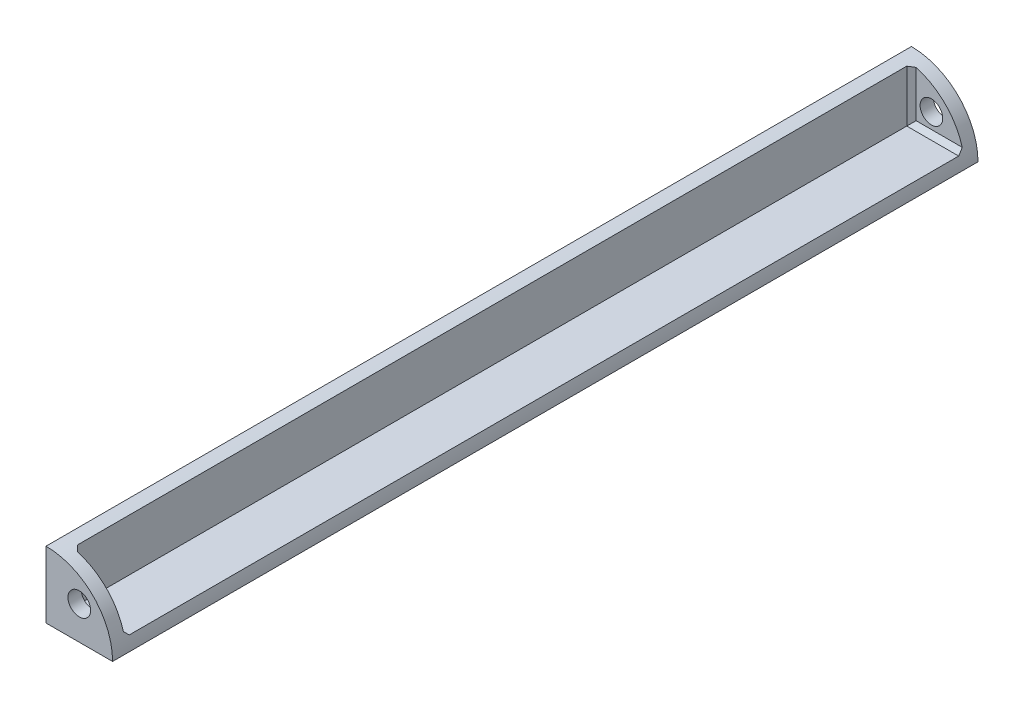
ISO-10303-21;
HEADER;
FILE_DESCRIPTION(('STEP AP214'),'2;1');
FILE_NAME('part.step','',(''),(''),'','','');
FILE_SCHEMA(('AUTOMOTIVE_DESIGN { 1 0 10303 214 1 1 1 1 }'));
ENDSEC;
DATA;
#1=APPLICATION_CONTEXT('core data for automotive mechanical design processes');
#2=APPLICATION_PROTOCOL_DEFINITION('international standard','automotive_design',2000,#1);
#3=PRODUCT_CONTEXT('',#1,'mechanical');
#4=PRODUCT('Part','Part','',(#3));
#5=PRODUCT_RELATED_PRODUCT_CATEGORY('part','',(#4));
#6=PRODUCT_DEFINITION_FORMATION('','',#4);
#7=PRODUCT_DEFINITION_CONTEXT('part definition',#1,'design');
#8=PRODUCT_DEFINITION('design','',#6,#7);
#9=PRODUCT_DEFINITION_SHAPE('','',#8);
#10=(LENGTH_UNIT() NAMED_UNIT(*) SI_UNIT(.MILLI.,.METRE.));
#11=(NAMED_UNIT(*) PLANE_ANGLE_UNIT() SI_UNIT($,.RADIAN.));
#12=(NAMED_UNIT(*) SI_UNIT($,.STERADIAN.) SOLID_ANGLE_UNIT());
#13=UNCERTAINTY_MEASURE_WITH_UNIT(LENGTH_MEASURE(1.E-05),#10,'distance_accuracy_value','');
#14=(GEOMETRIC_REPRESENTATION_CONTEXT(3) GLOBAL_UNCERTAINTY_ASSIGNED_CONTEXT((#13)) GLOBAL_UNIT_ASSIGNED_CONTEXT((#10,
#11,#12)) REPRESENTATION_CONTEXT('',''));
#15=CARTESIAN_POINT('',(0.,0.,0.));
#16=DIRECTION('',(0.,0.,1.));
#17=DIRECTION('',(1.,0.,0.));
#18=AXIS2_PLACEMENT_3D('',#15,#16,#17);
#19=CARTESIAN_POINT('',(0.,0.,2.));
#20=DIRECTION('',(0.,0.,1.));
#21=DIRECTION('',(1.,0.,0.));
#22=AXIS2_PLACEMENT_3D('',#19,#20,#21);
#23=PLANE('',#22);
#24=CARTESIAN_POINT('',(5.,5.,2.));
#25=DIRECTION('',(0.,0.,1.));
#26=DIRECTION('',(1.,0.,0.));
#27=AXIS2_PLACEMENT_3D('',#24,#25,#26);
#28=CIRCLE('',#27,1.7);
#29=CARTESIAN_POINT('',(6.7,5.,2.));
#30=VERTEX_POINT('',#29);
#31=EDGE_CURVE('E172',#30,#30,#28,.T.);
#32=ORIENTED_EDGE('',*,*,#31,.F.);
#33=EDGE_LOOP('',(#32));
#34=FACE_BOUND('',#33,.T.);
#35=CARTESIAN_POINT('',(0.,0.,2.));
#36=DIRECTION('',(0.,0.,1.));
#37=DIRECTION('',(1.,0.,0.));
#38=AXIS2_PLACEMENT_3D('',#35,#36,#37);
#39=CIRCLE('',#38,10.);
#40=CARTESIAN_POINT('',(9.62860322165163,2.69999999999998,2.));
#41=VERTEX_POINT('',#40);
#42=CARTESIAN_POINT('',(2.69999999999998,9.62860322165163,2.));
#43=VERTEX_POINT('',#42);
#44=EDGE_CURVE('E180',#41,#43,#39,.T.);
#45=ORIENTED_EDGE('',*,*,#44,.T.);
#46=DIRECTION('',(0.,-1.,0.));
#47=VECTOR('',#46,1.);
#48=CARTESIAN_POINT('',(2.69999999999998,0.,2.));
#49=LINE('',#48,#47);
#50=CARTESIAN_POINT('',(2.69999999999998,2.69999999999998,2.));
#51=VERTEX_POINT('',#50);
#52=EDGE_CURVE('E206',#43,#51,#49,.T.);
#53=ORIENTED_EDGE('',*,*,#52,.T.);
#54=DIRECTION('',(1.,0.,0.));
#55=VECTOR('',#54,1.);
#56=CARTESIAN_POINT('',(9.79795897113272,2.69999999999998,2.));
#57=LINE('',#56,#55);
#58=EDGE_CURVE('E203',#51,#41,#57,.T.);
#59=ORIENTED_EDGE('',*,*,#58,.T.);
#60=EDGE_LOOP('',(#45,#53,#59));
#61=FACE_BOUND('',#60,.T.);
#62=ADVANCED_FACE('F43',(#34,#61),#23,.T.);
#63=CARTESIAN_POINT('',(0.,0.,0.));
#64=DIRECTION('',(0.,0.,1.));
#65=DIRECTION('',(1.,0.,0.));
#66=AXIS2_PLACEMENT_3D('',#63,#64,#65);
#67=PLANE('',#66);
#68=DIRECTION('',(1.,0.,0.));
#69=VECTOR('',#68,1.);
#70=CARTESIAN_POINT('',(0.,0.,0.));
#71=LINE('',#70,#69);
#72=CARTESIAN_POINT('',(0.,0.,0.));
#73=VERTEX_POINT('',#72);
#74=CARTESIAN_POINT('',(10.,0.,0.));
#75=VERTEX_POINT('',#74);
#76=EDGE_CURVE('E176',#73,#75,#71,.T.);
#77=ORIENTED_EDGE('',*,*,#76,.F.);
#78=DIRECTION('',(0.,-1.,0.));
#79=VECTOR('',#78,1.);
#80=CARTESIAN_POINT('',(0.,0.,0.));
#81=LINE('',#80,#79);
#82=CARTESIAN_POINT('',(0.,10.,0.));
#83=VERTEX_POINT('',#82);
#84=EDGE_CURVE('E184',#83,#73,#81,.T.);
#85=ORIENTED_EDGE('',*,*,#84,.F.);
#86=CARTESIAN_POINT('',(0.,0.,0.));
#87=DIRECTION('',(0.,0.,1.));
#88=DIRECTION('',(1.,0.,0.));
#89=AXIS2_PLACEMENT_3D('',#86,#87,#88);
#90=CIRCLE('',#89,10.);
#91=EDGE_CURVE('E123',#75,#83,#90,.T.);
#92=ORIENTED_EDGE('',*,*,#91,.F.);
#93=EDGE_LOOP('',(#77,#85,#92));
#94=FACE_BOUND('',#93,.T.);
#95=CARTESIAN_POINT('',(5.,5.,0.));
#96=DIRECTION('',(0.,0.,1.));
#97=DIRECTION('',(1.,0.,0.));
#98=AXIS2_PLACEMENT_3D('',#95,#96,#97);
#99=CIRCLE('',#98,1.7);
#100=CARTESIAN_POINT('',(6.7,5.,0.));
#101=VERTEX_POINT('',#100);
#102=EDGE_CURVE('E171',#101,#101,#99,.T.);
#103=ORIENTED_EDGE('',*,*,#102,.T.);
#104=EDGE_LOOP('',(#103));
#105=FACE_BOUND('',#104,.T.);
#106=ADVANCED_FACE('F271',(#94,#105),#67,.F.);
#107=CARTESIAN_POINT('',(0.,0.,2.));
#108=DIRECTION('',(0.,1.,0.));
#109=DIRECTION('',(0.,0.,1.));
#110=AXIS2_PLACEMENT_3D('',#107,#108,#109);
#111=PLANE('',#110);
#112=ORIENTED_EDGE('',*,*,#76,.T.);
#113=DIRECTION('',(0.,0.,-1.));
#114=VECTOR('',#113,1.);
#115=CARTESIAN_POINT('',(10.,0.,2.));
#116=LINE('',#115,#114);
#117=CARTESIAN_POINT('',(10.,0.,130.));
#118=VERTEX_POINT('',#117);
#119=EDGE_CURVE('E127',#118,#75,#116,.T.);
#120=ORIENTED_EDGE('',*,*,#119,.F.);
#121=DIRECTION('',(1.,0.,0.));
#122=VECTOR('',#121,1.);
#123=CARTESIAN_POINT('',(0.,0.,130.));
#124=LINE('',#123,#122);
#125=CARTESIAN_POINT('',(0.,0.,130.));
#126=VERTEX_POINT('',#125);
#127=EDGE_CURVE('E138',#126,#118,#124,.T.);
#128=ORIENTED_EDGE('',*,*,#127,.F.);
#129=DIRECTION('',(0.,0.,-1.));
#130=VECTOR('',#129,1.);
#131=CARTESIAN_POINT('',(0.,0.,2.));
#132=LINE('',#131,#130);
#133=EDGE_CURVE('E128',#126,#73,#132,.T.);
#134=ORIENTED_EDGE('',*,*,#133,.T.);
#135=EDGE_LOOP('',(#112,#120,#128,#134));
#136=FACE_BOUND('',#135,.T.);
#137=ADVANCED_FACE('F277',(#136),#111,.F.);
#138=CARTESIAN_POINT('',(0.,0.,2.));
#139=DIRECTION('',(0.,0.,-1.));
#140=DIRECTION('',(-1.,0.,0.));
#141=AXIS2_PLACEMENT_3D('',#138,#139,#140);
#142=CYLINDRICAL_SURFACE('',#141,10.);
#143=DIRECTION('',(0.,0.,-1.));
#144=VECTOR('',#143,1.);
#145=CARTESIAN_POINT('',(0.,10.,2.));
#146=LINE('',#145,#144);
#147=CARTESIAN_POINT('',(0.,10.,130.));
#148=VERTEX_POINT('',#147);
#149=EDGE_CURVE('E117',#148,#83,#146,.T.);
#150=ORIENTED_EDGE('',*,*,#149,.F.);
#151=CARTESIAN_POINT('',(-8.66494376250415E-13,-8.66494376250415E-13,130.));
#152=DIRECTION('',(0.,0.,1.));
#153=DIRECTION('',(1.,0.,0.));
#154=AXIS2_PLACEMENT_3D('',#151,#152,#153);
#155=CIRCLE('',#154,10.0000000000009);
#156=EDGE_CURVE('E122',#148,#118,#155,.F.);
#157=ORIENTED_EDGE('',*,*,#156,.T.);
#158=ORIENTED_EDGE('',*,*,#119,.T.);
#159=ORIENTED_EDGE('',*,*,#91,.T.);
#160=EDGE_LOOP('',(#150,#157,#158,#159));
#161=FACE_BOUND('',#160,.T.);
#162=CARTESIAN_POINT('',(-8.66494376250415E-13,-8.66494376250415E-13,128.));
#163=DIRECTION('',(0.,0.,1.));
#164=DIRECTION('',(1.,0.,0.));
#165=AXIS2_PLACEMENT_3D('',#162,#163,#164);
#166=CIRCLE('',#165,10.0000000000009);
#167=CARTESIAN_POINT('',(2.69999999999999,9.62860322165142,128.));
#168=VERTEX_POINT('',#167);
#169=CARTESIAN_POINT('',(9.62860322165142,2.69999999999999,128.));
#170=VERTEX_POINT('',#169);
#171=EDGE_CURVE('E147',#168,#170,#166,.F.);
#172=ORIENTED_EDGE('',*,*,#171,.F.);
#173=CARTESIAN_POINT('',(0.,0.,125.3));
#174=DIRECTION('',(0.707106781186548,0.,-0.707106781186548));
#175=DIRECTION('',(-0.707106781186548,0.,-0.707106781186548));
#176=AXIS2_PLACEMENT_3D('',#173,#174,#175);
#177=ELLIPSE('',#176,14.1421356237309,10.);
#178=CARTESIAN_POINT('',(1.99999999999999,9.79795897113272,127.3));
#179=VERTEX_POINT('',#178);
#180=EDGE_CURVE('E11',#168,#179,#177,.F.);
#181=ORIENTED_EDGE('',*,*,#180,.T.);
#182=DIRECTION('',(0.,0.,-1.));
#183=VECTOR('',#182,1.);
#184=CARTESIAN_POINT('',(1.99999999999999,9.79795897113272,128.));
#185=LINE('',#184,#183);
#186=CARTESIAN_POINT('',(1.99999999999999,9.79795897113272,2.69999999999998));
#187=VERTEX_POINT('',#186);
#188=EDGE_CURVE('E163',#179,#187,#185,.T.);
#189=ORIENTED_EDGE('',*,*,#188,.T.);
#190=CARTESIAN_POINT('',(0.,0.,4.69999999999993));
#191=DIRECTION('',(-0.707106781186541,0.,-0.707106781186554));
#192=DIRECTION('',(0.707106781186554,0.,-0.707106781186541));
#193=AXIS2_PLACEMENT_3D('',#190,#191,#192);
#194=ELLIPSE('',#193,14.1421356237308,10.);
#195=EDGE_CURVE('E221',#187,#43,#194,.T.);
#196=ORIENTED_EDGE('',*,*,#195,.T.);
#197=ORIENTED_EDGE('',*,*,#44,.F.);
#198=CARTESIAN_POINT('',(0.,0.,4.69999999999993));
#199=DIRECTION('',(0.,0.707106781186541,0.707106781186554));
#200=DIRECTION('',(0.,0.707106781186554,-0.707106781186541));
#201=AXIS2_PLACEMENT_3D('',#198,#199,#200);
#202=ELLIPSE('',#201,14.1421356237308,10.);
#203=CARTESIAN_POINT('',(9.79795897113272,1.99999999999999,2.69999999999998));
#204=VERTEX_POINT('',#203);
#205=EDGE_CURVE('E224',#41,#204,#202,.F.);
#206=ORIENTED_EDGE('',*,*,#205,.T.);
#207=DIRECTION('',(0.,0.,-1.));
#208=VECTOR('',#207,1.);
#209=CARTESIAN_POINT('',(9.79795897113272,1.99999999999999,128.));
#210=LINE('',#209,#208);
#211=CARTESIAN_POINT('',(9.79795897113272,1.99999999999999,127.3));
#212=VERTEX_POINT('',#211);
#213=EDGE_CURVE('E156',#212,#204,#210,.T.);
#214=ORIENTED_EDGE('',*,*,#213,.F.);
#215=CARTESIAN_POINT('',(0.,0.,125.3));
#216=DIRECTION('',(0.,-0.707106781186548,0.707106781186548));
#217=DIRECTION('',(0.,-0.707106781186548,-0.707106781186548));
#218=AXIS2_PLACEMENT_3D('',#215,#216,#217);
#219=ELLIPSE('',#218,14.1421356237309,10.);
#220=EDGE_CURVE('E54',#212,#170,#219,.T.);
#221=ORIENTED_EDGE('',*,*,#220,.T.);
#222=EDGE_LOOP('',(#172,#181,#189,#196,#197,#206,#214,#221));
#223=FACE_BOUND('',#222,.T.);
#224=ADVANCED_FACE('F119',(#161,#223),#142,.T.);
#225=CARTESIAN_POINT('',(0.,0.,2.));
#226=DIRECTION('',(1.,0.,0.));
#227=DIRECTION('',(0.,0.,-1.));
#228=AXIS2_PLACEMENT_3D('',#225,#226,#227);
#229=PLANE('',#228);
#230=ORIENTED_EDGE('',*,*,#84,.T.);
#231=ORIENTED_EDGE('',*,*,#133,.F.);
#232=DIRECTION('',(0.,-1.,0.));
#233=VECTOR('',#232,1.);
#234=CARTESIAN_POINT('',(0.,0.,130.));
#235=LINE('',#234,#233);
#236=EDGE_CURVE('E131',#148,#126,#235,.T.);
#237=ORIENTED_EDGE('',*,*,#236,.F.);
#238=ORIENTED_EDGE('',*,*,#149,.T.);
#239=EDGE_LOOP('',(#230,#231,#237,#238));
#240=FACE_BOUND('',#239,.T.);
#241=ADVANCED_FACE('F132',(#240),#229,.F.);
#242=CARTESIAN_POINT('',(5.,5.,2.));
#243=DIRECTION('',(0.,0.,-1.));
#244=DIRECTION('',(-1.,0.,0.));
#245=AXIS2_PLACEMENT_3D('',#242,#243,#244);
#246=CYLINDRICAL_SURFACE('',#245,1.7);
#247=ORIENTED_EDGE('',*,*,#31,.T.);
#248=EDGE_LOOP('',(#247));
#249=FACE_BOUND('',#248,.T.);
#250=ORIENTED_EDGE('',*,*,#102,.F.);
#251=EDGE_LOOP('',(#250));
#252=FACE_BOUND('',#251,.T.);
#253=ADVANCED_FACE('F260',(#249,#252),#246,.F.);
#254=CARTESIAN_POINT('',(0.,1.99999999999999,128.));
#255=DIRECTION('',(0.,1.,0.));
#256=DIRECTION('',(0.,0.,1.));
#257=AXIS2_PLACEMENT_3D('',#254,#255,#256);
#258=PLANE('',#257);
#259=ORIENTED_EDGE('',*,*,#213,.T.);
#260=DIRECTION('',(-1.,0.,0.));
#261=VECTOR('',#260,1.);
#262=CARTESIAN_POINT('',(1.99999999999999,1.99999999999999,2.69999999999998));
#263=LINE('',#262,#261);
#264=CARTESIAN_POINT('',(1.99999999999999,1.99999999999999,2.69999999999998));
#265=VERTEX_POINT('',#264);
#266=EDGE_CURVE('E213',#204,#265,#263,.T.);
#267=ORIENTED_EDGE('',*,*,#266,.T.);
#268=DIRECTION('',(0.,0.,-1.));
#269=VECTOR('',#268,1.);
#270=CARTESIAN_POINT('',(1.99999999999999,1.99999999999999,128.));
#271=LINE('',#270,#269);
#272=CARTESIAN_POINT('',(1.99999999999999,1.99999999999999,127.3));
#273=VERTEX_POINT('',#272);
#274=EDGE_CURVE('E167',#273,#265,#271,.T.);
#275=ORIENTED_EDGE('',*,*,#274,.F.);
#276=DIRECTION('',(1.,0.,0.));
#277=VECTOR('',#276,1.);
#278=CARTESIAN_POINT('',(0.,1.99999999999999,127.3));
#279=LINE('',#278,#277);
#280=EDGE_CURVE('E209',#273,#212,#279,.T.);
#281=ORIENTED_EDGE('',*,*,#280,.T.);
#282=EDGE_LOOP('',(#259,#267,#275,#281));
#283=FACE_BOUND('',#282,.T.);
#284=ADVANCED_FACE('F258',(#283),#258,.T.);
#285=CARTESIAN_POINT('',(1.99999999999999,0.,128.));
#286=DIRECTION('',(-1.,0.,0.));
#287=DIRECTION('',(0.,0.,1.));
#288=AXIS2_PLACEMENT_3D('',#285,#286,#287);
#289=PLANE('',#288);
#290=ORIENTED_EDGE('',*,*,#274,.T.);
#291=DIRECTION('',(0.,1.,0.));
#292=VECTOR('',#291,1.);
#293=CARTESIAN_POINT('',(1.99999999999999,0.,2.69999999999998));
#294=LINE('',#293,#292);
#295=EDGE_CURVE('E199',#265,#187,#294,.T.);
#296=ORIENTED_EDGE('',*,*,#295,.T.);
#297=ORIENTED_EDGE('',*,*,#188,.F.);
#298=DIRECTION('',(0.,-1.,0.));
#299=VECTOR('',#298,1.);
#300=CARTESIAN_POINT('',(1.99999999999999,1.99999999999999,127.3));
#301=LINE('',#300,#299);
#302=EDGE_CURVE('E196',#179,#273,#301,.T.);
#303=ORIENTED_EDGE('',*,*,#302,.T.);
#304=EDGE_LOOP('',(#290,#296,#297,#303));
#305=FACE_BOUND('',#304,.T.);
#306=ADVANCED_FACE('F247',(#305),#289,.F.);
#307=CARTESIAN_POINT('',(5.,5.,130.));
#308=DIRECTION('',(0.,0.,-1.));
#309=DIRECTION('',(-1.,0.,0.));
#310=AXIS2_PLACEMENT_3D('',#307,#308,#309);
#311=CYLINDRICAL_SURFACE('',#310,1.7);
#312=CARTESIAN_POINT('',(5.,5.,130.));
#313=DIRECTION('',(0.,0.,1.));
#314=DIRECTION('',(1.,0.,0.));
#315=AXIS2_PLACEMENT_3D('',#312,#313,#314);
#316=CIRCLE('',#315,1.7);
#317=CARTESIAN_POINT('',(6.7,5.,130.));
#318=VERTEX_POINT('',#317);
#319=EDGE_CURVE('E152',#318,#318,#316,.T.);
#320=ORIENTED_EDGE('',*,*,#319,.T.);
#321=EDGE_LOOP('',(#320));
#322=FACE_BOUND('',#321,.T.);
#323=CARTESIAN_POINT('',(5.,5.,128.));
#324=DIRECTION('',(0.,0.,1.));
#325=DIRECTION('',(1.,0.,0.));
#326=AXIS2_PLACEMENT_3D('',#323,#324,#325);
#327=CIRCLE('',#326,1.7);
#328=CARTESIAN_POINT('',(6.7,5.,128.));
#329=VERTEX_POINT('',#328);
#330=EDGE_CURVE('E143',#329,#329,#327,.T.);
#331=ORIENTED_EDGE('',*,*,#330,.F.);
#332=EDGE_LOOP('',(#331));
#333=FACE_BOUND('',#332,.T.);
#334=ADVANCED_FACE('F266',(#322,#333),#311,.F.);
#335=CARTESIAN_POINT('',(0.,0.,130.));
#336=DIRECTION('',(0.,0.,1.));
#337=DIRECTION('',(1.,0.,0.));
#338=AXIS2_PLACEMENT_3D('',#335,#336,#337);
#339=PLANE('',#338);
#340=ORIENTED_EDGE('',*,*,#156,.F.);
#341=ORIENTED_EDGE('',*,*,#236,.T.);
#342=ORIENTED_EDGE('',*,*,#127,.T.);
#343=EDGE_LOOP('',(#340,#341,#342));
#344=FACE_BOUND('',#343,.T.);
#345=ORIENTED_EDGE('',*,*,#319,.F.);
#346=EDGE_LOOP('',(#345));
#347=FACE_BOUND('',#346,.T.);
#348=ADVANCED_FACE('F140',(#344,#347),#339,.T.);
#349=CARTESIAN_POINT('',(0.,0.,128.));
#350=DIRECTION('',(0.,0.,1.));
#351=DIRECTION('',(1.,0.,0.));
#352=AXIS2_PLACEMENT_3D('',#349,#350,#351);
#353=PLANE('',#352);
#354=ORIENTED_EDGE('',*,*,#171,.T.);
#355=DIRECTION('',(-1.,0.,0.));
#356=VECTOR('',#355,1.);
#357=CARTESIAN_POINT('',(0.,2.69999999999999,128.));
#358=LINE('',#357,#356);
#359=CARTESIAN_POINT('',(2.69999999999999,2.69999999999999,128.));
#360=VERTEX_POINT('',#359);
#361=EDGE_CURVE('E62',#170,#360,#358,.T.);
#362=ORIENTED_EDGE('',*,*,#361,.T.);
#363=DIRECTION('',(0.,1.,0.));
#364=VECTOR('',#363,1.);
#365=CARTESIAN_POINT('',(2.69999999999999,9.79795897113256,128.));
#366=LINE('',#365,#364);
#367=EDGE_CURVE('E216',#360,#168,#366,.T.);
#368=ORIENTED_EDGE('',*,*,#367,.T.);
#369=EDGE_LOOP('',(#354,#362,#368));
#370=FACE_BOUND('',#369,.T.);
#371=ORIENTED_EDGE('',*,*,#330,.T.);
#372=EDGE_LOOP('',(#371));
#373=FACE_BOUND('',#372,.T.);
#374=ADVANCED_FACE('F243',(#370,#373),#353,.F.);
#375=CARTESIAN_POINT('',(0.,2.69999999999998,2.));
#376=DIRECTION('',(0.,0.707106781186541,0.707106781186554));
#377=DIRECTION('',(-1.,0.,0.));
#378=AXIS2_PLACEMENT_3D('',#375,#376,#377);
#379=PLANE('',#378);
#380=ORIENTED_EDGE('',*,*,#205,.F.);
#381=ORIENTED_EDGE('',*,*,#58,.F.);
#382=DIRECTION('',(0.577350269189629,0.577350269189629,-0.577350269189619));
#383=VECTOR('',#382,1.);
#384=CARTESIAN_POINT('',(1.33333333333332,1.33333333333332,3.36666666666664));
#385=LINE('',#384,#383);
#386=EDGE_CURVE('E158',#265,#51,#385,.T.);
#387=ORIENTED_EDGE('',*,*,#386,.F.);
#388=ORIENTED_EDGE('',*,*,#266,.F.);
#389=EDGE_LOOP('',(#380,#381,#387,#388));
#390=FACE_BOUND('',#389,.T.);
#391=ADVANCED_FACE('F255',(#390),#379,.T.);
#392=CARTESIAN_POINT('',(1.99999999999999,0.,2.69999999999998));
#393=DIRECTION('',(-0.707106781186541,0.,-0.707106781186554));
#394=DIRECTION('',(0.,1.,0.));
#395=AXIS2_PLACEMENT_3D('',#392,#393,#394);
#396=PLANE('',#395);
#397=ORIENTED_EDGE('',*,*,#386,.T.);
#398=ORIENTED_EDGE('',*,*,#52,.F.);
#399=ORIENTED_EDGE('',*,*,#195,.F.);
#400=ORIENTED_EDGE('',*,*,#295,.F.);
#401=EDGE_LOOP('',(#397,#398,#399,#400));
#402=FACE_BOUND('',#401,.T.);
#403=ADVANCED_FACE('F249',(#402),#396,.F.);
#404=CARTESIAN_POINT('',(2.69999999999999,0.,128.));
#405=DIRECTION('',(0.707106781186548,0.,-0.707106781186548));
#406=DIRECTION('',(0.,-1.,0.));
#407=AXIS2_PLACEMENT_3D('',#404,#405,#406);
#408=PLANE('',#407);
#409=ORIENTED_EDGE('',*,*,#180,.F.);
#410=ORIENTED_EDGE('',*,*,#367,.F.);
#411=DIRECTION('',(0.577350269189626,0.577350269189626,0.577350269189626));
#412=VECTOR('',#411,1.);
#413=CARTESIAN_POINT('',(1.33333333333332,1.33333333333332,126.633333333333));
#414=LINE('',#413,#412);
#415=EDGE_CURVE('E48',#273,#360,#414,.T.);
#416=ORIENTED_EDGE('',*,*,#415,.F.);
#417=ORIENTED_EDGE('',*,*,#302,.F.);
#418=EDGE_LOOP('',(#409,#410,#416,#417));
#419=FACE_BOUND('',#418,.T.);
#420=ADVANCED_FACE('F46',(#419),#408,.T.);
#421=CARTESIAN_POINT('',(0.,1.99999999999999,127.3));
#422=DIRECTION('',(0.,-0.707106781186548,0.707106781186548));
#423=DIRECTION('',(1.,0.,0.));
#424=AXIS2_PLACEMENT_3D('',#421,#422,#423);
#425=PLANE('',#424);
#426=ORIENTED_EDGE('',*,*,#415,.T.);
#427=ORIENTED_EDGE('',*,*,#361,.F.);
#428=ORIENTED_EDGE('',*,*,#220,.F.);
#429=ORIENTED_EDGE('',*,*,#280,.F.);
#430=EDGE_LOOP('',(#426,#427,#428,#429));
#431=FACE_BOUND('',#430,.T.);
#432=ADVANCED_FACE('F239',(#431),#425,.F.);
#433=CLOSED_SHELL('',(#62,#106,#137,#224,#241,#253,#284,#306,#334,#348,#374,#391,#403,#420,#432));
#434=MANIFOLD_SOLID_BREP('B2',#433);
#435=ADVANCED_BREP_SHAPE_REPRESENTATION('',(#18,#434),#14);
#436=SHAPE_DEFINITION_REPRESENTATION(#9,#435);
ENDSEC;
END-ISO-10303-21;
